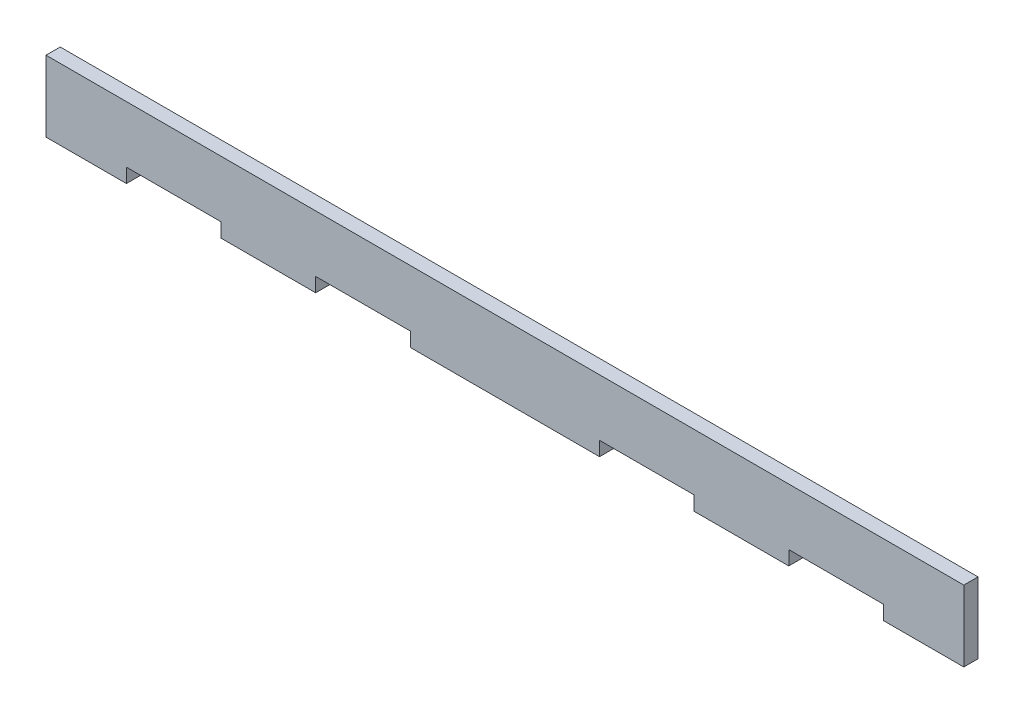
ISO-10303-21;
HEADER;
FILE_DESCRIPTION(('STEP AP214'),'2;1');
FILE_NAME('part.step','',(''),(''),'','','');
FILE_SCHEMA(('AUTOMOTIVE_DESIGN { 1 0 10303 214 1 1 1 1 }'));
ENDSEC;
DATA;
#1=APPLICATION_CONTEXT('core data for automotive mechanical design processes');
#2=APPLICATION_PROTOCOL_DEFINITION('international standard','automotive_design',2000,#1);
#3=PRODUCT_CONTEXT('',#1,'mechanical');
#4=PRODUCT('Part','Part','',(#3));
#5=PRODUCT_RELATED_PRODUCT_CATEGORY('part','',(#4));
#6=PRODUCT_DEFINITION_FORMATION('','',#4);
#7=PRODUCT_DEFINITION_CONTEXT('part definition',#1,'design');
#8=PRODUCT_DEFINITION('design','',#6,#7);
#9=PRODUCT_DEFINITION_SHAPE('','',#8);
#10=(LENGTH_UNIT() NAMED_UNIT(*) SI_UNIT(.MILLI.,.METRE.));
#11=(NAMED_UNIT(*) PLANE_ANGLE_UNIT() SI_UNIT($,.RADIAN.));
#12=(NAMED_UNIT(*) SI_UNIT($,.STERADIAN.) SOLID_ANGLE_UNIT());
#13=UNCERTAINTY_MEASURE_WITH_UNIT(LENGTH_MEASURE(1.E-05),#10,'distance_accuracy_value','');
#14=(GEOMETRIC_REPRESENTATION_CONTEXT(3) GLOBAL_UNCERTAINTY_ASSIGNED_CONTEXT((#13)) GLOBAL_UNIT_ASSIGNED_CONTEXT((#10,
#11,#12)) REPRESENTATION_CONTEXT('',''));
#15=CARTESIAN_POINT('',(0.,0.,0.));
#16=DIRECTION('',(0.,0.,1.));
#17=DIRECTION('',(1.,0.,0.));
#18=AXIS2_PLACEMENT_3D('',#15,#16,#17);
#19=CARTESIAN_POINT('',(100.,-7.49999999999999,3.));
#20=DIRECTION('',(0.,1.,0.));
#21=DIRECTION('',(-1.,0.,0.));
#22=AXIS2_PLACEMENT_3D('',#19,#20,#21);
#23=PLANE('',#22);
#24=DIRECTION('',(1.,0.,0.));
#25=VECTOR('',#24,1.);
#26=CARTESIAN_POINT('',(100.,-7.49999999999999,0.));
#27=LINE('',#26,#25);
#28=CARTESIAN_POINT('',(40.0000000000001,-7.50000000000002,0.));
#29=VERTEX_POINT('',#28);
#30=CARTESIAN_POINT('',(60.0000000000001,-7.50000000000002,0.));
#31=VERTEX_POINT('',#30);
#32=EDGE_CURVE('E206',#29,#31,#27,.T.);
#33=ORIENTED_EDGE('',*,*,#32,.T.);
#34=DIRECTION('',(0.,0.,1.));
#35=VECTOR('',#34,1.);
#36=CARTESIAN_POINT('',(60.0000000000001,-7.50000000000002,0.));
#37=LINE('',#36,#35);
#38=CARTESIAN_POINT('',(60.0000000000001,-7.50000000000002,3.));
#39=VERTEX_POINT('',#38);
#40=EDGE_CURVE('E258',#31,#39,#37,.T.);
#41=ORIENTED_EDGE('',*,*,#40,.T.);
#42=DIRECTION('',(1.,0.,0.));
#43=VECTOR('',#42,1.);
#44=CARTESIAN_POINT('',(100.,-7.49999999999999,3.));
#45=LINE('',#44,#43);
#46=CARTESIAN_POINT('',(40.0000000000001,-7.50000000000002,3.));
#47=VERTEX_POINT('',#46);
#48=EDGE_CURVE('E330',#47,#39,#45,.T.);
#49=ORIENTED_EDGE('',*,*,#48,.F.);
#50=DIRECTION('',(0.,0.,1.));
#51=VECTOR('',#50,1.);
#52=CARTESIAN_POINT('',(40.0000000000001,-7.50000000000002,0.));
#53=LINE('',#52,#51);
#54=EDGE_CURVE('E286',#29,#47,#53,.T.);
#55=ORIENTED_EDGE('',*,*,#54,.F.);
#56=EDGE_LOOP('',(#33,#41,#49,#55));
#57=FACE_BOUND('',#56,.T.);
#58=ADVANCED_FACE('F37',(#57),#23,.F.);
#59=CARTESIAN_POINT('',(-19.9999999999999,-7.50000000000002,0.));
#60=VERTEX_POINT('',#59);
#61=CARTESIAN_POINT('',(20.0000000000001,-7.50000000000002,0.));
#62=VERTEX_POINT('',#61);
#63=EDGE_CURVE('E202',#60,#62,#27,.T.);
#64=ORIENTED_EDGE('',*,*,#63,.T.);
#65=DIRECTION('',(0.,0.,1.));
#66=VECTOR('',#65,1.);
#67=CARTESIAN_POINT('',(20.0000000000001,-7.50000000000002,0.));
#68=LINE('',#67,#66);
#69=CARTESIAN_POINT('',(20.0000000000001,-7.50000000000002,3.));
#70=VERTEX_POINT('',#69);
#71=EDGE_CURVE('E283',#62,#70,#68,.T.);
#72=ORIENTED_EDGE('',*,*,#71,.T.);
#73=CARTESIAN_POINT('',(-19.9999999999999,-7.50000000000002,3.));
#74=VERTEX_POINT('',#73);
#75=EDGE_CURVE('E327',#74,#70,#45,.T.);
#76=ORIENTED_EDGE('',*,*,#75,.F.);
#77=DIRECTION('',(0.,0.,1.));
#78=VECTOR('',#77,1.);
#79=CARTESIAN_POINT('',(-19.9999999999999,-7.50000000000002,0.));
#80=LINE('',#79,#78);
#81=EDGE_CURVE('E186',#60,#74,#80,.T.);
#82=ORIENTED_EDGE('',*,*,#81,.F.);
#83=EDGE_LOOP('',(#64,#72,#76,#82));
#84=FACE_BOUND('',#83,.T.);
#85=ADVANCED_FACE('F325',(#84),#23,.F.);
#86=CARTESIAN_POINT('',(-59.9999999999999,-7.50000000000002,0.));
#87=VERTEX_POINT('',#86);
#88=CARTESIAN_POINT('',(-39.9999999999999,-7.50000000000002,0.));
#89=VERTEX_POINT('',#88);
#90=EDGE_CURVE('E193',#87,#89,#27,.T.);
#91=ORIENTED_EDGE('',*,*,#90,.T.);
#92=DIRECTION('',(0.,0.,1.));
#93=VECTOR('',#92,1.);
#94=CARTESIAN_POINT('',(-39.9999999999999,-7.50000000000002,0.));
#95=LINE('',#94,#93);
#96=CARTESIAN_POINT('',(-39.9999999999999,-7.50000000000002,3.));
#97=VERTEX_POINT('',#96);
#98=EDGE_CURVE('E175',#89,#97,#95,.T.);
#99=ORIENTED_EDGE('',*,*,#98,.T.);
#100=CARTESIAN_POINT('',(-59.9999999999999,-7.50000000000002,3.));
#101=VERTEX_POINT('',#100);
#102=EDGE_CURVE('E210',#101,#97,#45,.T.);
#103=ORIENTED_EDGE('',*,*,#102,.F.);
#104=DIRECTION('',(0.,0.,1.));
#105=VECTOR('',#104,1.);
#106=CARTESIAN_POINT('',(-59.9999999999999,-7.50000000000002,0.));
#107=LINE('',#106,#105);
#108=EDGE_CURVE('E200',#87,#101,#107,.T.);
#109=ORIENTED_EDGE('',*,*,#108,.F.);
#110=EDGE_LOOP('',(#91,#99,#103,#109));
#111=FACE_BOUND('',#110,.T.);
#112=ADVANCED_FACE('F199',(#111),#23,.F.);
#113=CARTESIAN_POINT('',(-96.9999999999999,-7.50000000000002,0.));
#114=VERTEX_POINT('',#113);
#115=CARTESIAN_POINT('',(-79.9999999999999,-7.50000000000002,0.));
#116=VERTEX_POINT('',#115);
#117=EDGE_CURVE('E201',#114,#116,#27,.T.);
#118=ORIENTED_EDGE('',*,*,#117,.T.);
#119=DIRECTION('',(0.,0.,1.));
#120=VECTOR('',#119,1.);
#121=CARTESIAN_POINT('',(-79.9999999999999,-7.50000000000002,0.));
#122=LINE('',#121,#120);
#123=CARTESIAN_POINT('',(-79.9999999999999,-7.50000000000002,3.));
#124=VERTEX_POINT('',#123);
#125=EDGE_CURVE('E224',#116,#124,#122,.T.);
#126=ORIENTED_EDGE('',*,*,#125,.T.);
#127=CARTESIAN_POINT('',(-96.9999999999999,-7.50000000000002,3.));
#128=VERTEX_POINT('',#127);
#129=EDGE_CURVE('E46',#128,#124,#45,.T.);
#130=ORIENTED_EDGE('',*,*,#129,.F.);
#131=DIRECTION('',(0.,0.,1.));
#132=VECTOR('',#131,1.);
#133=CARTESIAN_POINT('',(-96.9999999999999,-7.50000000000002,0.));
#134=LINE('',#133,#132);
#135=EDGE_CURVE('E212',#114,#128,#134,.T.);
#136=ORIENTED_EDGE('',*,*,#135,.F.);
#137=EDGE_LOOP('',(#118,#126,#130,#136));
#138=FACE_BOUND('',#137,.T.);
#139=ADVANCED_FACE('F352',(#138),#23,.F.);
#140=CARTESIAN_POINT('',(80.0000000000001,-7.50000000000002,3.));
#141=VERTEX_POINT('',#140);
#142=CARTESIAN_POINT('',(97.0000000000001,-7.49999999999999,3.));
#143=VERTEX_POINT('',#142);
#144=EDGE_CURVE('E211',#141,#143,#45,.T.);
#145=ORIENTED_EDGE('',*,*,#144,.F.);
#146=DIRECTION('',(0.,0.,1.));
#147=VECTOR('',#146,1.);
#148=CARTESIAN_POINT('',(80.0000000000001,-7.50000000000002,0.));
#149=LINE('',#148,#147);
#150=CARTESIAN_POINT('',(80.0000000000001,-7.50000000000002,0.));
#151=VERTEX_POINT('',#150);
#152=EDGE_CURVE('E261',#151,#141,#149,.T.);
#153=ORIENTED_EDGE('',*,*,#152,.F.);
#154=CARTESIAN_POINT('',(97.0000000000001,-7.49999999999999,0.));
#155=VERTEX_POINT('',#154);
#156=EDGE_CURVE('E204',#151,#155,#27,.T.);
#157=ORIENTED_EDGE('',*,*,#156,.T.);
#158=DIRECTION('',(0.,0.,1.));
#159=VECTOR('',#158,1.);
#160=CARTESIAN_POINT('',(97.0000000000001,-7.49999999999999,0.));
#161=LINE('',#160,#159);
#162=EDGE_CURVE('E221',#155,#143,#161,.T.);
#163=ORIENTED_EDGE('',*,*,#162,.T.);
#164=EDGE_LOOP('',(#145,#153,#157,#163));
#165=FACE_BOUND('',#164,.T.);
#166=ADVANCED_FACE('F39',(#165),#23,.F.);
#167=CARTESIAN_POINT('',(100.,7.50000000000001,3.));
#168=DIRECTION('',(0.,-1.,0.));
#169=DIRECTION('',(1.,0.,0.));
#170=AXIS2_PLACEMENT_3D('',#167,#168,#169);
#171=PLANE('',#170);
#172=DIRECTION('',(-1.,0.,0.));
#173=VECTOR('',#172,1.);
#174=CARTESIAN_POINT('',(100.,7.50000000000001,3.));
#175=LINE('',#174,#173);
#176=CARTESIAN_POINT('',(97.0000000000001,7.50000000000001,3.));
#177=VERTEX_POINT('',#176);
#178=CARTESIAN_POINT('',(-96.9999999999999,7.49999999999998,3.));
#179=VERTEX_POINT('',#178);
#180=EDGE_CURVE('E11',#177,#179,#175,.T.);
#181=ORIENTED_EDGE('',*,*,#180,.F.);
#182=DIRECTION('',(0.,0.,1.));
#183=VECTOR('',#182,1.);
#184=CARTESIAN_POINT('',(97.0000000000001,7.50000000000001,0.));
#185=LINE('',#184,#183);
#186=CARTESIAN_POINT('',(97.0000000000001,7.50000000000001,0.));
#187=VERTEX_POINT('',#186);
#188=EDGE_CURVE('E250',#187,#177,#185,.T.);
#189=ORIENTED_EDGE('',*,*,#188,.F.);
#190=DIRECTION('',(-1.,0.,0.));
#191=VECTOR('',#190,1.);
#192=CARTESIAN_POINT('',(100.,7.50000000000001,0.));
#193=LINE('',#192,#191);
#194=CARTESIAN_POINT('',(-96.9999999999999,7.49999999999998,0.));
#195=VERTEX_POINT('',#194);
#196=EDGE_CURVE('E41',#187,#195,#193,.T.);
#197=ORIENTED_EDGE('',*,*,#196,.T.);
#198=DIRECTION('',(0.,0.,1.));
#199=VECTOR('',#198,1.);
#200=CARTESIAN_POINT('',(-96.9999999999999,7.49999999999998,0.));
#201=LINE('',#200,#199);
#202=EDGE_CURVE('E214',#195,#179,#201,.T.);
#203=ORIENTED_EDGE('',*,*,#202,.T.);
#204=EDGE_LOOP('',(#181,#189,#197,#203));
#205=FACE_BOUND('',#204,.T.);
#206=ADVANCED_FACE('F344',(#205),#171,.F.);
#207=CARTESIAN_POINT('',(0.,0.,3.));
#208=DIRECTION('',(0.,0.,1.));
#209=DIRECTION('',(1.,0.,0.));
#210=AXIS2_PLACEMENT_3D('',#207,#208,#209);
#211=PLANE('',#210);
#212=DIRECTION('',(0.,-1.,0.));
#213=VECTOR('',#212,1.);
#214=CARTESIAN_POINT('',(60.0000000000001,-4.5,3.));
#215=LINE('',#214,#213);
#216=CARTESIAN_POINT('',(60.0000000000001,-4.5,3.));
#217=VERTEX_POINT('',#216);
#218=EDGE_CURVE('E275',#217,#39,#215,.T.);
#219=ORIENTED_EDGE('',*,*,#218,.F.);
#220=DIRECTION('',(-1.,0.,0.));
#221=VECTOR('',#220,1.);
#222=CARTESIAN_POINT('',(60.0000000000001,-4.5,3.));
#223=LINE('',#222,#221);
#224=CARTESIAN_POINT('',(80.0000000000001,-4.5,3.));
#225=VERTEX_POINT('',#224);
#226=EDGE_CURVE('E268',#225,#217,#223,.T.);
#227=ORIENTED_EDGE('',*,*,#226,.F.);
#228=DIRECTION('',(0.,1.,0.));
#229=VECTOR('',#228,1.);
#230=CARTESIAN_POINT('',(80.0000000000001,-4.5,3.));
#231=LINE('',#230,#229);
#232=EDGE_CURVE('E272',#141,#225,#231,.T.);
#233=ORIENTED_EDGE('',*,*,#232,.F.);
#234=ORIENTED_EDGE('',*,*,#144,.T.);
#235=DIRECTION('',(0.,-1.,0.));
#236=VECTOR('',#235,1.);
#237=CARTESIAN_POINT('',(97.0000000000001,-7.49999999999999,3.));
#238=LINE('',#237,#236);
#239=EDGE_CURVE('E233',#177,#143,#238,.T.);
#240=ORIENTED_EDGE('',*,*,#239,.F.);
#241=ORIENTED_EDGE('',*,*,#180,.T.);
#242=DIRECTION('',(0.,1.,0.));
#243=VECTOR('',#242,1.);
#244=CARTESIAN_POINT('',(-96.9999999999999,7.49999999999998,3.));
#245=LINE('',#244,#243);
#246=EDGE_CURVE('E218',#128,#179,#245,.T.);
#247=ORIENTED_EDGE('',*,*,#246,.F.);
#248=ORIENTED_EDGE('',*,*,#129,.T.);
#249=DIRECTION('',(0.,-1.,0.));
#250=VECTOR('',#249,1.);
#251=CARTESIAN_POINT('',(-79.9999999999999,-4.50000000000002,3.));
#252=LINE('',#251,#250);
#253=CARTESIAN_POINT('',(-79.9999999999999,-4.50000000000002,3.));
#254=VERTEX_POINT('',#253);
#255=EDGE_CURVE('E241',#254,#124,#252,.T.);
#256=ORIENTED_EDGE('',*,*,#255,.F.);
#257=DIRECTION('',(-1.,0.,0.));
#258=VECTOR('',#257,1.);
#259=CARTESIAN_POINT('',(-79.9999999999999,-4.50000000000002,3.));
#260=LINE('',#259,#258);
#261=CARTESIAN_POINT('',(-59.9999999999999,-4.50000000000002,3.));
#262=VERTEX_POINT('',#261);
#263=EDGE_CURVE('E234',#262,#254,#260,.T.);
#264=ORIENTED_EDGE('',*,*,#263,.F.);
#265=DIRECTION('',(0.,1.,0.));
#266=VECTOR('',#265,1.);
#267=CARTESIAN_POINT('',(-59.9999999999999,-4.50000000000002,3.));
#268=LINE('',#267,#266);
#269=EDGE_CURVE('E238',#101,#262,#268,.T.);
#270=ORIENTED_EDGE('',*,*,#269,.F.);
#271=ORIENTED_EDGE('',*,*,#102,.T.);
#272=DIRECTION('',(0.,-1.,0.));
#273=VECTOR('',#272,1.);
#274=CARTESIAN_POINT('',(-39.9999999999999,-4.50000000000001,3.));
#275=LINE('',#274,#273);
#276=CARTESIAN_POINT('',(-39.9999999999999,-4.50000000000001,3.));
#277=VERTEX_POINT('',#276);
#278=EDGE_CURVE('E181',#277,#97,#275,.T.);
#279=ORIENTED_EDGE('',*,*,#278,.F.);
#280=DIRECTION('',(-1.,0.,0.));
#281=VECTOR('',#280,1.);
#282=CARTESIAN_POINT('',(-39.9999999999999,-4.50000000000001,3.));
#283=LINE('',#282,#281);
#284=CARTESIAN_POINT('',(-19.9999999999999,-4.50000000000001,3.));
#285=VERTEX_POINT('',#284);
#286=EDGE_CURVE('E196',#285,#277,#283,.T.);
#287=ORIENTED_EDGE('',*,*,#286,.F.);
#288=DIRECTION('',(0.,1.,0.));
#289=VECTOR('',#288,1.);
#290=CARTESIAN_POINT('',(-19.9999999999999,-4.50000000000001,3.));
#291=LINE('',#290,#289);
#292=EDGE_CURVE('E312',#74,#285,#291,.T.);
#293=ORIENTED_EDGE('',*,*,#292,.F.);
#294=ORIENTED_EDGE('',*,*,#75,.T.);
#295=DIRECTION('',(0.,-1.,0.));
#296=VECTOR('',#295,1.);
#297=CARTESIAN_POINT('',(20.0000000000001,-4.5,3.));
#298=LINE('',#297,#296);
#299=CARTESIAN_POINT('',(20.0000000000001,-4.5,3.));
#300=VERTEX_POINT('',#299);
#301=EDGE_CURVE('E267',#300,#70,#298,.T.);
#302=ORIENTED_EDGE('',*,*,#301,.F.);
#303=DIRECTION('',(-1.,0.,0.));
#304=VECTOR('',#303,1.);
#305=CARTESIAN_POINT('',(20.0000000000001,-4.5,3.));
#306=LINE('',#305,#304);
#307=CARTESIAN_POINT('',(40.0000000000001,-4.5,3.));
#308=VERTEX_POINT('',#307);
#309=EDGE_CURVE('E292',#308,#300,#306,.T.);
#310=ORIENTED_EDGE('',*,*,#309,.F.);
#311=DIRECTION('',(0.,1.,0.));
#312=VECTOR('',#311,1.);
#313=CARTESIAN_POINT('',(40.0000000000001,-4.5,3.));
#314=LINE('',#313,#312);
#315=EDGE_CURVE('E296',#47,#308,#314,.T.);
#316=ORIENTED_EDGE('',*,*,#315,.F.);
#317=ORIENTED_EDGE('',*,*,#48,.T.);
#318=EDGE_LOOP('',(#219,#227,#233,#234,#240,#241,#247,#248,#256,#264,#270,#271,#279,#287,#293,
#294,#302,#310,#316,#317));
#319=FACE_BOUND('',#318,.T.);
#320=ADVANCED_FACE('F354',(#319),#211,.T.);
#321=CARTESIAN_POINT('',(0.,0.,0.));
#322=DIRECTION('',(0.,0.,1.));
#323=DIRECTION('',(1.,0.,0.));
#324=AXIS2_PLACEMENT_3D('',#321,#322,#323);
#325=PLANE('',#324);
#326=DIRECTION('',(-1.,0.,0.));
#327=VECTOR('',#326,1.);
#328=CARTESIAN_POINT('',(60.0000000000001,-4.5,0.));
#329=LINE('',#328,#327);
#330=CARTESIAN_POINT('',(80.0000000000001,-4.5,0.));
#331=VERTEX_POINT('',#330);
#332=CARTESIAN_POINT('',(60.0000000000001,-4.5,0.));
#333=VERTEX_POINT('',#332);
#334=EDGE_CURVE('E54',#331,#333,#329,.T.);
#335=ORIENTED_EDGE('',*,*,#334,.T.);
#336=DIRECTION('',(0.,-1.,0.));
#337=VECTOR('',#336,1.);
#338=CARTESIAN_POINT('',(60.0000000000001,-4.5,0.));
#339=LINE('',#338,#337);
#340=EDGE_CURVE('E271',#333,#31,#339,.T.);
#341=ORIENTED_EDGE('',*,*,#340,.T.);
#342=ORIENTED_EDGE('',*,*,#32,.F.);
#343=DIRECTION('',(0.,1.,0.));
#344=VECTOR('',#343,1.);
#345=CARTESIAN_POINT('',(40.0000000000001,-4.5,0.));
#346=LINE('',#345,#344);
#347=CARTESIAN_POINT('',(40.0000000000001,-4.5,0.));
#348=VERTEX_POINT('',#347);
#349=EDGE_CURVE('E301',#29,#348,#346,.T.);
#350=ORIENTED_EDGE('',*,*,#349,.T.);
#351=DIRECTION('',(-1.,0.,0.));
#352=VECTOR('',#351,1.);
#353=CARTESIAN_POINT('',(20.0000000000001,-4.5,0.));
#354=LINE('',#353,#352);
#355=CARTESIAN_POINT('',(20.0000000000001,-4.5,0.));
#356=VERTEX_POINT('',#355);
#357=EDGE_CURVE('E62',#348,#356,#354,.T.);
#358=ORIENTED_EDGE('',*,*,#357,.T.);
#359=DIRECTION('',(0.,-1.,0.));
#360=VECTOR('',#359,1.);
#361=CARTESIAN_POINT('',(20.0000000000001,-4.5,0.));
#362=LINE('',#361,#360);
#363=EDGE_CURVE('E295',#356,#62,#362,.T.);
#364=ORIENTED_EDGE('',*,*,#363,.T.);
#365=ORIENTED_EDGE('',*,*,#63,.F.);
#366=DIRECTION('',(0.,1.,0.));
#367=VECTOR('',#366,1.);
#368=CARTESIAN_POINT('',(-19.9999999999999,-4.50000000000001,0.));
#369=LINE('',#368,#367);
#370=CARTESIAN_POINT('',(-19.9999999999999,-4.50000000000001,0.));
#371=VERTEX_POINT('',#370);
#372=EDGE_CURVE('E195',#60,#371,#369,.T.);
#373=ORIENTED_EDGE('',*,*,#372,.T.);
#374=DIRECTION('',(-1.,0.,0.));
#375=VECTOR('',#374,1.);
#376=CARTESIAN_POINT('',(-39.9999999999999,-4.50000000000001,0.));
#377=LINE('',#376,#375);
#378=CARTESIAN_POINT('',(-39.9999999999999,-4.50000000000001,0.));
#379=VERTEX_POINT('',#378);
#380=EDGE_CURVE('E187',#371,#379,#377,.T.);
#381=ORIENTED_EDGE('',*,*,#380,.T.);
#382=DIRECTION('',(0.,-1.,0.));
#383=VECTOR('',#382,1.);
#384=CARTESIAN_POINT('',(-39.9999999999999,-4.50000000000001,0.));
#385=LINE('',#384,#383);
#386=EDGE_CURVE('E178',#379,#89,#385,.T.);
#387=ORIENTED_EDGE('',*,*,#386,.T.);
#388=ORIENTED_EDGE('',*,*,#90,.F.);
#389=DIRECTION('',(0.,1.,0.));
#390=VECTOR('',#389,1.);
#391=CARTESIAN_POINT('',(-59.9999999999999,-4.50000000000002,0.));
#392=LINE('',#391,#390);
#393=CARTESIAN_POINT('',(-59.9999999999999,-4.50000000000002,0.));
#394=VERTEX_POINT('',#393);
#395=EDGE_CURVE('E246',#87,#394,#392,.T.);
#396=ORIENTED_EDGE('',*,*,#395,.T.);
#397=DIRECTION('',(-1.,0.,0.));
#398=VECTOR('',#397,1.);
#399=CARTESIAN_POINT('',(-79.9999999999999,-4.50000000000002,0.));
#400=LINE('',#399,#398);
#401=CARTESIAN_POINT('',(-79.9999999999999,-4.50000000000002,0.));
#402=VERTEX_POINT('',#401);
#403=EDGE_CURVE('E227',#394,#402,#400,.T.);
#404=ORIENTED_EDGE('',*,*,#403,.T.);
#405=DIRECTION('',(0.,-1.,0.));
#406=VECTOR('',#405,1.);
#407=CARTESIAN_POINT('',(-79.9999999999999,-4.50000000000002,0.));
#408=LINE('',#407,#406);
#409=EDGE_CURVE('E237',#402,#116,#408,.T.);
#410=ORIENTED_EDGE('',*,*,#409,.T.);
#411=ORIENTED_EDGE('',*,*,#117,.F.);
#412=DIRECTION('',(0.,1.,0.));
#413=VECTOR('',#412,1.);
#414=CARTESIAN_POINT('',(-96.9999999999999,7.49999999999998,0.));
#415=LINE('',#414,#413);
#416=EDGE_CURVE('E215',#114,#195,#415,.T.);
#417=ORIENTED_EDGE('',*,*,#416,.T.);
#418=ORIENTED_EDGE('',*,*,#196,.F.);
#419=DIRECTION('',(0.,-1.,0.));
#420=VECTOR('',#419,1.);
#421=CARTESIAN_POINT('',(97.0000000000001,-7.49999999999999,0.));
#422=LINE('',#421,#420);
#423=EDGE_CURVE('E252',#187,#155,#422,.T.);
#424=ORIENTED_EDGE('',*,*,#423,.T.);
#425=ORIENTED_EDGE('',*,*,#156,.F.);
#426=DIRECTION('',(0.,1.,0.));
#427=VECTOR('',#426,1.);
#428=CARTESIAN_POINT('',(80.0000000000001,-4.5,0.));
#429=LINE('',#428,#427);
#430=EDGE_CURVE('E278',#151,#331,#429,.T.);
#431=ORIENTED_EDGE('',*,*,#430,.T.);
#432=EDGE_LOOP('',(#335,#341,#342,#350,#358,#364,#365,#373,#381,#387,#388,#396,#404,#410,#411,
#417,#418,#424,#425,#431));
#433=FACE_BOUND('',#432,.T.);
#434=ADVANCED_FACE('F191',(#433),#325,.F.);
#435=CARTESIAN_POINT('',(-96.9999999999999,7.49999999999998,0.));
#436=DIRECTION('',(1.,0.,0.));
#437=DIRECTION('',(0.,0.,-1.));
#438=AXIS2_PLACEMENT_3D('',#435,#436,#437);
#439=PLANE('',#438);
#440=ORIENTED_EDGE('',*,*,#246,.T.);
#441=ORIENTED_EDGE('',*,*,#202,.F.);
#442=ORIENTED_EDGE('',*,*,#416,.F.);
#443=ORIENTED_EDGE('',*,*,#135,.T.);
#444=EDGE_LOOP('',(#440,#441,#442,#443));
#445=FACE_BOUND('',#444,.T.);
#446=ADVANCED_FACE('F346',(#445),#439,.F.);
#447=CARTESIAN_POINT('',(97.0000000000001,-7.49999999999999,0.));
#448=DIRECTION('',(-1.,0.,0.));
#449=DIRECTION('',(0.,0.,1.));
#450=AXIS2_PLACEMENT_3D('',#447,#448,#449);
#451=PLANE('',#450);
#452=ORIENTED_EDGE('',*,*,#239,.T.);
#453=ORIENTED_EDGE('',*,*,#162,.F.);
#454=ORIENTED_EDGE('',*,*,#423,.F.);
#455=ORIENTED_EDGE('',*,*,#188,.T.);
#456=EDGE_LOOP('',(#452,#453,#454,#455));
#457=FACE_BOUND('',#456,.T.);
#458=ADVANCED_FACE('F357',(#457),#451,.F.);
#459=CARTESIAN_POINT('',(-79.9999999999999,-4.50000000000002,0.));
#460=DIRECTION('',(-1.,0.,0.));
#461=DIRECTION('',(0.,0.,1.));
#462=AXIS2_PLACEMENT_3D('',#459,#460,#461);
#463=PLANE('',#462);
#464=ORIENTED_EDGE('',*,*,#255,.T.);
#465=ORIENTED_EDGE('',*,*,#125,.F.);
#466=ORIENTED_EDGE('',*,*,#409,.F.);
#467=DIRECTION('',(0.,0.,1.));
#468=VECTOR('',#467,1.);
#469=CARTESIAN_POINT('',(-79.9999999999999,-4.50000000000002,0.));
#470=LINE('',#469,#468);
#471=EDGE_CURVE('E231',#402,#254,#470,.T.);
#472=ORIENTED_EDGE('',*,*,#471,.T.);
#473=EDGE_LOOP('',(#464,#465,#466,#472));
#474=FACE_BOUND('',#473,.T.);
#475=ADVANCED_FACE('F420',(#474),#463,.F.);
#476=CARTESIAN_POINT('',(-79.9999999999999,-4.50000000000002,0.));
#477=DIRECTION('',(0.,1.,0.));
#478=DIRECTION('',(0.,0.,1.));
#479=AXIS2_PLACEMENT_3D('',#476,#477,#478);
#480=PLANE('',#479);
#481=ORIENTED_EDGE('',*,*,#263,.T.);
#482=ORIENTED_EDGE('',*,*,#471,.F.);
#483=ORIENTED_EDGE('',*,*,#403,.F.);
#484=DIRECTION('',(0.,0.,1.));
#485=VECTOR('',#484,1.);
#486=CARTESIAN_POINT('',(-59.9999999999999,-4.50000000000002,0.));
#487=LINE('',#486,#485);
#488=EDGE_CURVE('E229',#394,#262,#487,.T.);
#489=ORIENTED_EDGE('',*,*,#488,.T.);
#490=EDGE_LOOP('',(#481,#482,#483,#489));
#491=FACE_BOUND('',#490,.T.);
#492=ADVANCED_FACE('F428',(#491),#480,.F.);
#493=CARTESIAN_POINT('',(-59.9999999999999,-4.50000000000002,0.));
#494=DIRECTION('',(1.,0.,0.));
#495=DIRECTION('',(0.,0.,-1.));
#496=AXIS2_PLACEMENT_3D('',#493,#494,#495);
#497=PLANE('',#496);
#498=ORIENTED_EDGE('',*,*,#269,.T.);
#499=ORIENTED_EDGE('',*,*,#488,.F.);
#500=ORIENTED_EDGE('',*,*,#395,.F.);
#501=ORIENTED_EDGE('',*,*,#108,.T.);
#502=EDGE_LOOP('',(#498,#499,#500,#501));
#503=FACE_BOUND('',#502,.T.);
#504=ADVANCED_FACE('F437',(#503),#497,.F.);
#505=CARTESIAN_POINT('',(-39.9999999999999,-4.50000000000001,0.));
#506=DIRECTION('',(-1.,0.,0.));
#507=DIRECTION('',(0.,0.,1.));
#508=AXIS2_PLACEMENT_3D('',#505,#506,#507);
#509=PLANE('',#508);
#510=ORIENTED_EDGE('',*,*,#278,.T.);
#511=ORIENTED_EDGE('',*,*,#98,.F.);
#512=ORIENTED_EDGE('',*,*,#386,.F.);
#513=DIRECTION('',(0.,0.,1.));
#514=VECTOR('',#513,1.);
#515=CARTESIAN_POINT('',(-39.9999999999999,-4.50000000000001,0.));
#516=LINE('',#515,#514);
#517=EDGE_CURVE('E243',#379,#277,#516,.T.);
#518=ORIENTED_EDGE('',*,*,#517,.T.);
#519=EDGE_LOOP('',(#510,#511,#512,#518));
#520=FACE_BOUND('',#519,.T.);
#521=ADVANCED_FACE('F177',(#520),#509,.F.);
#522=CARTESIAN_POINT('',(-39.9999999999999,-4.50000000000001,0.));
#523=DIRECTION('',(0.,1.,0.));
#524=DIRECTION('',(0.,0.,1.));
#525=AXIS2_PLACEMENT_3D('',#522,#523,#524);
#526=PLANE('',#525);
#527=ORIENTED_EDGE('',*,*,#286,.T.);
#528=ORIENTED_EDGE('',*,*,#517,.F.);
#529=ORIENTED_EDGE('',*,*,#380,.F.);
#530=DIRECTION('',(0.,0.,1.));
#531=VECTOR('',#530,1.);
#532=CARTESIAN_POINT('',(-19.9999999999999,-4.50000000000001,0.));
#533=LINE('',#532,#531);
#534=EDGE_CURVE('E307',#371,#285,#533,.T.);
#535=ORIENTED_EDGE('',*,*,#534,.T.);
#536=EDGE_LOOP('',(#527,#528,#529,#535));
#537=FACE_BOUND('',#536,.T.);
#538=ADVANCED_FACE('F454',(#537),#526,.F.);
#539=CARTESIAN_POINT('',(-19.9999999999999,-4.50000000000001,0.));
#540=DIRECTION('',(1.,0.,0.));
#541=DIRECTION('',(0.,0.,-1.));
#542=AXIS2_PLACEMENT_3D('',#539,#540,#541);
#543=PLANE('',#542);
#544=ORIENTED_EDGE('',*,*,#292,.T.);
#545=ORIENTED_EDGE('',*,*,#534,.F.);
#546=ORIENTED_EDGE('',*,*,#372,.F.);
#547=ORIENTED_EDGE('',*,*,#81,.T.);
#548=EDGE_LOOP('',(#544,#545,#546,#547));
#549=FACE_BOUND('',#548,.T.);
#550=ADVANCED_FACE('F321',(#549),#543,.F.);
#551=CARTESIAN_POINT('',(20.0000000000001,-4.5,0.));
#552=DIRECTION('',(-1.,0.,0.));
#553=DIRECTION('',(0.,0.,1.));
#554=AXIS2_PLACEMENT_3D('',#551,#552,#553);
#555=PLANE('',#554);
#556=ORIENTED_EDGE('',*,*,#301,.T.);
#557=ORIENTED_EDGE('',*,*,#71,.F.);
#558=ORIENTED_EDGE('',*,*,#363,.F.);
#559=DIRECTION('',(0.,0.,1.));
#560=VECTOR('',#559,1.);
#561=CARTESIAN_POINT('',(20.0000000000001,-4.5,0.));
#562=LINE('',#561,#560);
#563=EDGE_CURVE('E290',#356,#300,#562,.T.);
#564=ORIENTED_EDGE('',*,*,#563,.T.);
#565=EDGE_LOOP('',(#556,#557,#558,#564));
#566=FACE_BOUND('',#565,.T.);
#567=ADVANCED_FACE('F470',(#566),#555,.F.);
#568=CARTESIAN_POINT('',(20.0000000000001,-4.5,0.));
#569=DIRECTION('',(0.,1.,0.));
#570=DIRECTION('',(0.,0.,1.));
#571=AXIS2_PLACEMENT_3D('',#568,#569,#570);
#572=PLANE('',#571);
#573=ORIENTED_EDGE('',*,*,#309,.T.);
#574=ORIENTED_EDGE('',*,*,#563,.F.);
#575=ORIENTED_EDGE('',*,*,#357,.F.);
#576=DIRECTION('',(0.,0.,1.));
#577=VECTOR('',#576,1.);
#578=CARTESIAN_POINT('',(40.0000000000001,-4.5,0.));
#579=LINE('',#578,#577);
#580=EDGE_CURVE('E288',#348,#308,#579,.T.);
#581=ORIENTED_EDGE('',*,*,#580,.T.);
#582=EDGE_LOOP('',(#573,#574,#575,#581));
#583=FACE_BOUND('',#582,.T.);
#584=ADVANCED_FACE('F478',(#583),#572,.F.);
#585=CARTESIAN_POINT('',(40.0000000000001,-4.5,0.));
#586=DIRECTION('',(1.,0.,0.));
#587=DIRECTION('',(0.,0.,-1.));
#588=AXIS2_PLACEMENT_3D('',#585,#586,#587);
#589=PLANE('',#588);
#590=ORIENTED_EDGE('',*,*,#315,.T.);
#591=ORIENTED_EDGE('',*,*,#580,.F.);
#592=ORIENTED_EDGE('',*,*,#349,.F.);
#593=ORIENTED_EDGE('',*,*,#54,.T.);
#594=EDGE_LOOP('',(#590,#591,#592,#593));
#595=FACE_BOUND('',#594,.T.);
#596=ADVANCED_FACE('F487',(#595),#589,.F.);
#597=CARTESIAN_POINT('',(60.0000000000001,-4.5,0.));
#598=DIRECTION('',(-1.,0.,0.));
#599=DIRECTION('',(0.,0.,1.));
#600=AXIS2_PLACEMENT_3D('',#597,#598,#599);
#601=PLANE('',#600);
#602=ORIENTED_EDGE('',*,*,#218,.T.);
#603=ORIENTED_EDGE('',*,*,#40,.F.);
#604=ORIENTED_EDGE('',*,*,#340,.F.);
#605=DIRECTION('',(0.,0.,1.));
#606=VECTOR('',#605,1.);
#607=CARTESIAN_POINT('',(60.0000000000001,-4.5,0.));
#608=LINE('',#607,#606);
#609=EDGE_CURVE('E265',#333,#217,#608,.T.);
#610=ORIENTED_EDGE('',*,*,#609,.T.);
#611=EDGE_LOOP('',(#602,#603,#604,#610));
#612=FACE_BOUND('',#611,.T.);
#613=ADVANCED_FACE('F368',(#612),#601,.F.);
#614=CARTESIAN_POINT('',(60.0000000000001,-4.5,0.));
#615=DIRECTION('',(0.,1.,0.));
#616=DIRECTION('',(0.,0.,1.));
#617=AXIS2_PLACEMENT_3D('',#614,#615,#616);
#618=PLANE('',#617);
#619=ORIENTED_EDGE('',*,*,#226,.T.);
#620=ORIENTED_EDGE('',*,*,#609,.F.);
#621=ORIENTED_EDGE('',*,*,#334,.F.);
#622=DIRECTION('',(0.,0.,1.));
#623=VECTOR('',#622,1.);
#624=CARTESIAN_POINT('',(80.0000000000001,-4.5,0.));
#625=LINE('',#624,#623);
#626=EDGE_CURVE('E263',#331,#225,#625,.T.);
#627=ORIENTED_EDGE('',*,*,#626,.T.);
#628=EDGE_LOOP('',(#619,#620,#621,#627));
#629=FACE_BOUND('',#628,.T.);
#630=ADVANCED_FACE('F370',(#629),#618,.F.);
#631=CARTESIAN_POINT('',(80.0000000000001,-4.5,0.));
#632=DIRECTION('',(1.,0.,0.));
#633=DIRECTION('',(0.,0.,-1.));
#634=AXIS2_PLACEMENT_3D('',#631,#632,#633);
#635=PLANE('',#634);
#636=ORIENTED_EDGE('',*,*,#232,.T.);
#637=ORIENTED_EDGE('',*,*,#626,.F.);
#638=ORIENTED_EDGE('',*,*,#430,.F.);
#639=ORIENTED_EDGE('',*,*,#152,.T.);
#640=EDGE_LOOP('',(#636,#637,#638,#639));
#641=FACE_BOUND('',#640,.T.);
#642=ADVANCED_FACE('F372',(#641),#635,.F.);
#643=CLOSED_SHELL('',(#58,#85,#112,#139,#166,#206,#320,#434,#446,#458,#475,#492,#504,#521,#538,
#550,#567,#584,#596,#613,#630,#642));
#644=MANIFOLD_SOLID_BREP('B2',#643);
#645=ADVANCED_BREP_SHAPE_REPRESENTATION('',(#18,#644),#14);
#646=SHAPE_DEFINITION_REPRESENTATION(#9,#645);
ENDSEC;
END-ISO-10303-21;
